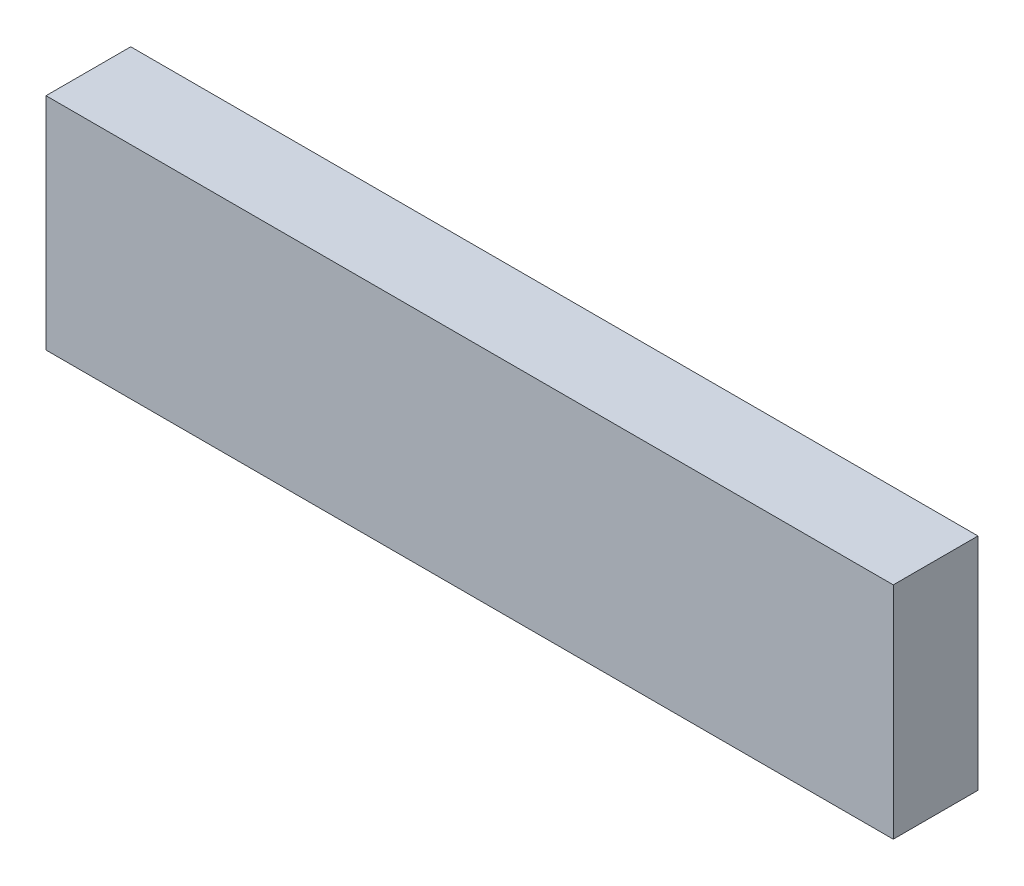
ISO-10303-21;
HEADER;
FILE_DESCRIPTION(('STEP AP214'),'2;1');
FILE_NAME('part.step','',(''),(''),'','','');
FILE_SCHEMA(('AUTOMOTIVE_DESIGN { 1 0 10303 214 1 1 1 1 }'));
ENDSEC;
DATA;
#1=APPLICATION_CONTEXT('core data for automotive mechanical design processes');
#2=APPLICATION_PROTOCOL_DEFINITION('international standard','automotive_design',2000,#1);
#3=PRODUCT_CONTEXT('',#1,'mechanical');
#4=PRODUCT('Part','Part','',(#3));
#5=PRODUCT_RELATED_PRODUCT_CATEGORY('part','',(#4));
#6=PRODUCT_DEFINITION_FORMATION('','',#4);
#7=PRODUCT_DEFINITION_CONTEXT('part definition',#1,'design');
#8=PRODUCT_DEFINITION('design','',#6,#7);
#9=PRODUCT_DEFINITION_SHAPE('','',#8);
#10=(LENGTH_UNIT() NAMED_UNIT(*) SI_UNIT(.MILLI.,.METRE.));
#11=(NAMED_UNIT(*) PLANE_ANGLE_UNIT() SI_UNIT($,.RADIAN.));
#12=(NAMED_UNIT(*) SI_UNIT($,.STERADIAN.) SOLID_ANGLE_UNIT());
#13=UNCERTAINTY_MEASURE_WITH_UNIT(LENGTH_MEASURE(1.E-05),#10,'distance_accuracy_value','');
#14=(GEOMETRIC_REPRESENTATION_CONTEXT(3) GLOBAL_UNCERTAINTY_ASSIGNED_CONTEXT((#13)) GLOBAL_UNIT_ASSIGNED_CONTEXT((#10,
#11,#12)) REPRESENTATION_CONTEXT('',''));
#15=CARTESIAN_POINT('',(0.,0.,0.));
#16=DIRECTION('',(0.,0.,1.));
#17=DIRECTION('',(1.,0.,0.));
#18=AXIS2_PLACEMENT_3D('',#15,#16,#17);
#19=CARTESIAN_POINT('',(-24.0943043801565,8.21370967741936,5.));
#20=DIRECTION('',(1.,0.,0.));
#21=DIRECTION('',(0.,1.,0.));
#22=AXIS2_PLACEMENT_3D('',#19,#20,#21);
#23=PLANE('',#22);
#24=DIRECTION('',(0.,-1.,0.));
#25=VECTOR('',#24,1.);
#26=CARTESIAN_POINT('',(-24.0943043801565,8.21370967741936,0.));
#27=LINE('',#26,#25);
#28=CARTESIAN_POINT('',(-24.0943043801565,8.21370967741936,0.));
#29=VERTEX_POINT('',#28);
#30=CARTESIAN_POINT('',(-24.0943043801565,-4.78629032258064,0.));
#31=VERTEX_POINT('',#30);
#32=EDGE_CURVE('E107',#29,#31,#27,.T.);
#33=ORIENTED_EDGE('',*,*,#32,.T.);
#34=DIRECTION('',(0.,0.,-1.));
#35=VECTOR('',#34,1.);
#36=CARTESIAN_POINT('',(-24.0943043801565,-4.78629032258064,5.));
#37=LINE('',#36,#35);
#38=CARTESIAN_POINT('',(-24.0943043801565,-4.78629032258064,5.));
#39=VERTEX_POINT('',#38);
#40=EDGE_CURVE('E11',#39,#31,#37,.T.);
#41=ORIENTED_EDGE('',*,*,#40,.F.);
#42=DIRECTION('',(0.,-1.,0.));
#43=VECTOR('',#42,1.);
#44=CARTESIAN_POINT('',(-24.0943043801565,8.21370967741936,5.));
#45=LINE('',#44,#43);
#46=CARTESIAN_POINT('',(-24.0943043801565,8.21370967741936,5.));
#47=VERTEX_POINT('',#46);
#48=EDGE_CURVE('E91',#47,#39,#45,.T.);
#49=ORIENTED_EDGE('',*,*,#48,.F.);
#50=DIRECTION('',(0.,0.,-1.));
#51=VECTOR('',#50,1.);
#52=CARTESIAN_POINT('',(-24.0943043801565,8.21370967741936,5.));
#53=LINE('',#52,#51);
#54=EDGE_CURVE('E103',#47,#29,#53,.T.);
#55=ORIENTED_EDGE('',*,*,#54,.T.);
#56=EDGE_LOOP('',(#33,#41,#49,#55));
#57=FACE_BOUND('',#56,.T.);
#58=ADVANCED_FACE('F39',(#57),#23,.F.);
#59=CARTESIAN_POINT('',(-24.0943043801565,-4.78629032258064,5.));
#60=DIRECTION('',(0.,1.,0.));
#61=DIRECTION('',(0.,0.,1.));
#62=AXIS2_PLACEMENT_3D('',#59,#60,#61);
#63=PLANE('',#62);
#64=DIRECTION('',(1.,0.,0.));
#65=VECTOR('',#64,1.);
#66=CARTESIAN_POINT('',(-24.0943043801565,-4.78629032258064,0.));
#67=LINE('',#66,#65);
#68=CARTESIAN_POINT('',(25.9056956198435,-4.78629032258064,0.));
#69=VERTEX_POINT('',#68);
#70=EDGE_CURVE('E96',#31,#69,#67,.T.);
#71=ORIENTED_EDGE('',*,*,#70,.T.);
#72=DIRECTION('',(0.,0.,-1.));
#73=VECTOR('',#72,1.);
#74=CARTESIAN_POINT('',(25.9056956198435,-4.78629032258064,5.));
#75=LINE('',#74,#73);
#76=CARTESIAN_POINT('',(25.9056956198435,-4.78629032258064,5.));
#77=VERTEX_POINT('',#76);
#78=EDGE_CURVE('E48',#77,#69,#75,.T.);
#79=ORIENTED_EDGE('',*,*,#78,.F.);
#80=DIRECTION('',(1.,0.,0.));
#81=VECTOR('',#80,1.);
#82=CARTESIAN_POINT('',(-24.0943043801565,-4.78629032258064,5.));
#83=LINE('',#82,#81);
#84=EDGE_CURVE('E86',#39,#77,#83,.T.);
#85=ORIENTED_EDGE('',*,*,#84,.F.);
#86=ORIENTED_EDGE('',*,*,#40,.T.);
#87=EDGE_LOOP('',(#71,#79,#85,#86));
#88=FACE_BOUND('',#87,.T.);
#89=ADVANCED_FACE('F95',(#88),#63,.F.);
#90=CARTESIAN_POINT('',(25.9056956198435,8.21370967741936,5.));
#91=DIRECTION('',(-1.,0.,0.));
#92=DIRECTION('',(0.,-1.,0.));
#93=AXIS2_PLACEMENT_3D('',#90,#91,#92);
#94=PLANE('',#93);
#95=DIRECTION('',(0.,1.,0.));
#96=VECTOR('',#95,1.);
#97=CARTESIAN_POINT('',(25.9056956198435,8.21370967741936,0.));
#98=LINE('',#97,#96);
#99=CARTESIAN_POINT('',(25.9056956198435,8.21370967741936,0.));
#100=VERTEX_POINT('',#99);
#101=EDGE_CURVE('E73',#69,#100,#98,.T.);
#102=ORIENTED_EDGE('',*,*,#101,.T.);
#103=DIRECTION('',(0.,0.,-1.));
#104=VECTOR('',#103,1.);
#105=CARTESIAN_POINT('',(25.9056956198435,8.21370967741936,5.));
#106=LINE('',#105,#104);
#107=CARTESIAN_POINT('',(25.9056956198435,8.21370967741936,5.));
#108=VERTEX_POINT('',#107);
#109=EDGE_CURVE('E98',#108,#100,#106,.T.);
#110=ORIENTED_EDGE('',*,*,#109,.F.);
#111=DIRECTION('',(0.,1.,0.));
#112=VECTOR('',#111,1.);
#113=CARTESIAN_POINT('',(25.9056956198435,8.21370967741936,5.));
#114=LINE('',#113,#112);
#115=EDGE_CURVE('E89',#77,#108,#114,.T.);
#116=ORIENTED_EDGE('',*,*,#115,.F.);
#117=ORIENTED_EDGE('',*,*,#78,.T.);
#118=EDGE_LOOP('',(#102,#110,#116,#117));
#119=FACE_BOUND('',#118,.T.);
#120=ADVANCED_FACE('F99',(#119),#94,.F.);
#121=CARTESIAN_POINT('',(-24.0943043801565,8.21370967741936,5.));
#122=DIRECTION('',(0.,-1.,0.));
#123=DIRECTION('',(0.,0.,-1.));
#124=AXIS2_PLACEMENT_3D('',#121,#122,#123);
#125=PLANE('',#124);
#126=DIRECTION('',(-1.,0.,0.));
#127=VECTOR('',#126,1.);
#128=CARTESIAN_POINT('',(-24.0943043801565,8.21370967741936,0.));
#129=LINE('',#128,#127);
#130=EDGE_CURVE('E79',#100,#29,#129,.T.);
#131=ORIENTED_EDGE('',*,*,#130,.T.);
#132=ORIENTED_EDGE('',*,*,#54,.F.);
#133=DIRECTION('',(-1.,0.,0.));
#134=VECTOR('',#133,1.);
#135=CARTESIAN_POINT('',(-24.0943043801565,8.21370967741936,5.));
#136=LINE('',#135,#134);
#137=EDGE_CURVE('E56',#108,#47,#136,.T.);
#138=ORIENTED_EDGE('',*,*,#137,.F.);
#139=ORIENTED_EDGE('',*,*,#109,.T.);
#140=EDGE_LOOP('',(#131,#132,#138,#139));
#141=FACE_BOUND('',#140,.T.);
#142=ADVANCED_FACE('F120',(#141),#125,.F.);
#143=CARTESIAN_POINT('',(0.,0.,5.));
#144=DIRECTION('',(0.,0.,1.));
#145=DIRECTION('',(1.,0.,0.));
#146=AXIS2_PLACEMENT_3D('',#143,#144,#145);
#147=PLANE('',#146);
#148=ORIENTED_EDGE('',*,*,#48,.T.);
#149=ORIENTED_EDGE('',*,*,#84,.T.);
#150=ORIENTED_EDGE('',*,*,#115,.T.);
#151=ORIENTED_EDGE('',*,*,#137,.T.);
#152=EDGE_LOOP('',(#148,#149,#150,#151));
#153=FACE_BOUND('',#152,.T.);
#154=ADVANCED_FACE('F87',(#153),#147,.T.);
#155=CARTESIAN_POINT('',(0.,0.,0.));
#156=DIRECTION('',(0.,0.,1.));
#157=DIRECTION('',(1.,0.,0.));
#158=AXIS2_PLACEMENT_3D('',#155,#156,#157);
#159=PLANE('',#158);
#160=ORIENTED_EDGE('',*,*,#32,.F.);
#161=ORIENTED_EDGE('',*,*,#130,.F.);
#162=ORIENTED_EDGE('',*,*,#101,.F.);
#163=ORIENTED_EDGE('',*,*,#70,.F.);
#164=EDGE_LOOP('',(#160,#161,#162,#163));
#165=FACE_BOUND('',#164,.T.);
#166=ADVANCED_FACE('F123',(#165),#159,.F.);
#167=CLOSED_SHELL('',(#58,#89,#120,#142,#154,#166));
#168=MANIFOLD_SOLID_BREP('B2',#167);
#169=ADVANCED_BREP_SHAPE_REPRESENTATION('',(#18,#168),#14);
#170=SHAPE_DEFINITION_REPRESENTATION(#9,#169);
ENDSEC;
END-ISO-10303-21;
